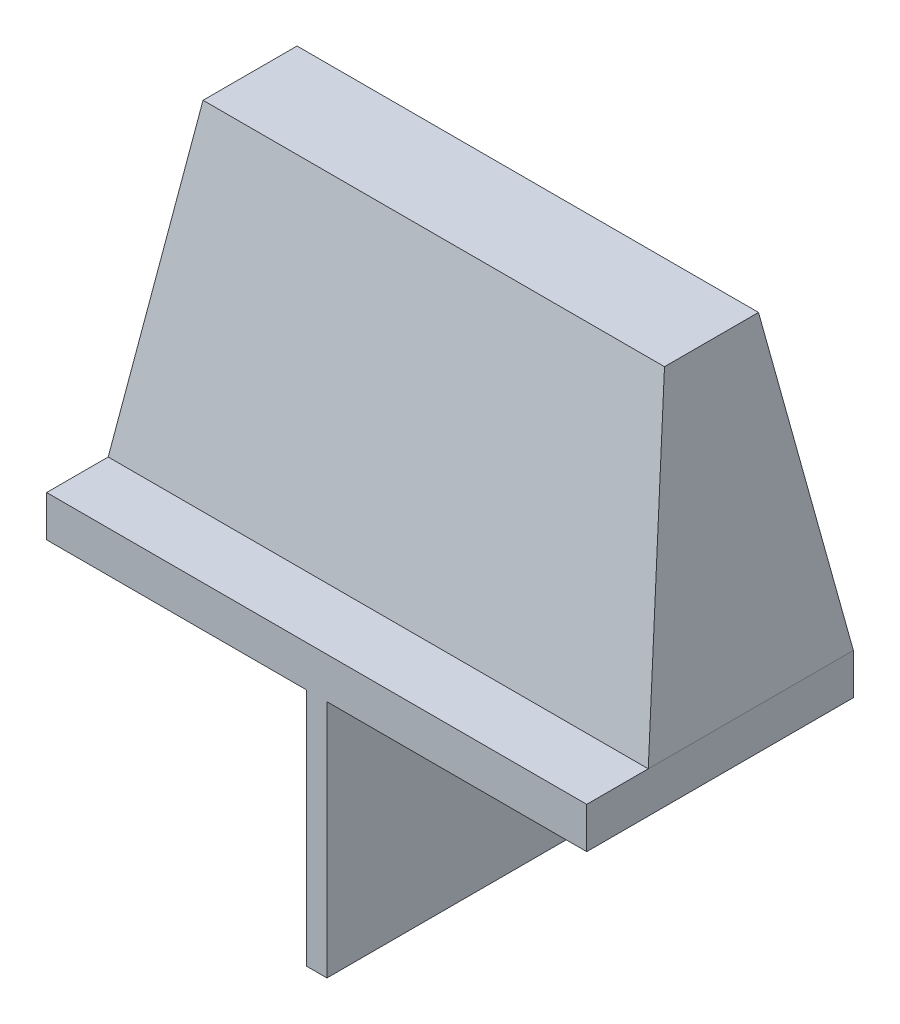
ISO-10303-21;
HEADER;
FILE_DESCRIPTION(('STEP AP214'),'2;1');
FILE_NAME('part.step','',(''),(''),'','','');
FILE_SCHEMA(('AUTOMOTIVE_DESIGN { 1 0 10303 214 1 1 1 1 }'));
ENDSEC;
DATA;
#1=APPLICATION_CONTEXT('core data for automotive mechanical design processes');
#2=APPLICATION_PROTOCOL_DEFINITION('international standard','automotive_design',2000,#1);
#3=PRODUCT_CONTEXT('',#1,'mechanical');
#4=PRODUCT('Part','Part','',(#3));
#5=PRODUCT_RELATED_PRODUCT_CATEGORY('part','',(#4));
#6=PRODUCT_DEFINITION_FORMATION('','',#4);
#7=PRODUCT_DEFINITION_CONTEXT('part definition',#1,'design');
#8=PRODUCT_DEFINITION('design','',#6,#7);
#9=PRODUCT_DEFINITION_SHAPE('','',#8);
#10=(LENGTH_UNIT() NAMED_UNIT(*) SI_UNIT(.MILLI.,.METRE.));
#11=(NAMED_UNIT(*) PLANE_ANGLE_UNIT() SI_UNIT($,.RADIAN.));
#12=(NAMED_UNIT(*) SI_UNIT($,.STERADIAN.) SOLID_ANGLE_UNIT());
#13=UNCERTAINTY_MEASURE_WITH_UNIT(LENGTH_MEASURE(1.E-05),#10,'distance_accuracy_value','');
#14=(GEOMETRIC_REPRESENTATION_CONTEXT(3) GLOBAL_UNCERTAINTY_ASSIGNED_CONTEXT((#13)) GLOBAL_UNIT_ASSIGNED_CONTEXT((#10,
#11,#12)) REPRESENTATION_CONTEXT('',''));
#15=CARTESIAN_POINT('',(0.,0.,0.));
#16=DIRECTION('',(0.,0.,1.));
#17=DIRECTION('',(1.,0.,0.));
#18=AXIS2_PLACEMENT_3D('',#15,#16,#17);
#19=CARTESIAN_POINT('',(0.,0.,0.));
#20=DIRECTION('',(0.,-1.,0.));
#21=DIRECTION('',(0.,0.,-1.));
#22=AXIS2_PLACEMENT_3D('',#19,#20,#21);
#23=PLANE('',#22);
#24=DIRECTION('',(-1.,0.,0.));
#25=VECTOR('',#24,1.);
#26=CARTESIAN_POINT('',(0.,0.,-19.812));
#27=LINE('',#26,#25);
#28=CARTESIAN_POINT('',(19.304,0.,-19.812));
#29=VERTEX_POINT('',#28);
#30=CARTESIAN_POINT('',(0.,0.,-19.812));
#31=VERTEX_POINT('',#30);
#32=EDGE_CURVE('E359',#29,#31,#27,.T.);
#33=ORIENTED_EDGE('',*,*,#32,.F.);
#34=DIRECTION('',(0.,0.,1.));
#35=VECTOR('',#34,1.);
#36=CARTESIAN_POINT('',(19.304,0.,-19.812));
#37=LINE('',#36,#35);
#38=CARTESIAN_POINT('',(19.304,0.,0.));
#39=VERTEX_POINT('',#38);
#40=EDGE_CURVE('E173',#29,#39,#37,.T.);
#41=ORIENTED_EDGE('',*,*,#40,.T.);
#42=DIRECTION('',(1.,0.,0.));
#43=VECTOR('',#42,1.);
#44=CARTESIAN_POINT('',(0.,0.,0.));
#45=LINE('',#44,#43);
#46=CARTESIAN_POINT('',(0.,0.,0.));
#47=VERTEX_POINT('',#46);
#48=EDGE_CURVE('E148',#47,#39,#45,.T.);
#49=ORIENTED_EDGE('',*,*,#48,.F.);
#50=DIRECTION('',(0.,0.,1.));
#51=VECTOR('',#50,1.);
#52=CARTESIAN_POINT('',(0.,0.,0.));
#53=LINE('',#52,#51);
#54=EDGE_CURVE('E310',#31,#47,#53,.T.);
#55=ORIENTED_EDGE('',*,*,#54,.F.);
#56=EDGE_LOOP('',(#33,#41,#49,#55));
#57=FACE_BOUND('',#56,.T.);
#58=ADVANCED_FACE('F53',(#57),#23,.T.);
#59=CARTESIAN_POINT('',(20.828,0.,0.));
#60=VERTEX_POINT('',#59);
#61=CARTESIAN_POINT('',(40.132,0.,0.));
#62=VERTEX_POINT('',#61);
#63=EDGE_CURVE('E368',#60,#62,#45,.T.);
#64=ORIENTED_EDGE('',*,*,#63,.F.);
#65=DIRECTION('',(0.,0.,-1.));
#66=VECTOR('',#65,1.);
#67=CARTESIAN_POINT('',(20.828,0.,-19.812));
#68=LINE('',#67,#66);
#69=CARTESIAN_POINT('',(20.828,0.,-19.812));
#70=VERTEX_POINT('',#69);
#71=EDGE_CURVE('E170',#60,#70,#68,.T.);
#72=ORIENTED_EDGE('',*,*,#71,.T.);
#73=CARTESIAN_POINT('',(40.132,0.,-19.812));
#74=VERTEX_POINT('',#73);
#75=EDGE_CURVE('E354',#74,#70,#27,.T.);
#76=ORIENTED_EDGE('',*,*,#75,.F.);
#77=DIRECTION('',(0.,0.,-1.));
#78=VECTOR('',#77,1.);
#79=CARTESIAN_POINT('',(40.132,0.,0.));
#80=LINE('',#79,#78);
#81=EDGE_CURVE('E298',#62,#74,#80,.T.);
#82=ORIENTED_EDGE('',*,*,#81,.F.);
#83=EDGE_LOOP('',(#64,#72,#76,#82));
#84=FACE_BOUND('',#83,.T.);
#85=ADVANCED_FACE('F455',(#84),#23,.T.);
#86=CARTESIAN_POINT('',(0.,0.,0.));
#87=DIRECTION('',(-1.,0.,0.));
#88=DIRECTION('',(0.,0.,1.));
#89=AXIS2_PLACEMENT_3D('',#86,#87,#88);
#90=PLANE('',#89);
#91=CARTESIAN_POINT('',(0.,3.048,-19.812));
#92=DIRECTION('',(0.,0.,1.));
#93=VECTOR('',#92,1.);
#94=LINE('',#91,#93);
#95=CARTESIAN_POINT('',(0.,3.048,-19.812));
#96=VERTEX_POINT('',#95);
#97=CARTESIAN_POINT('',(0.,3.048,-4.572));
#98=VERTEX_POINT('',#97);
#99=EDGE_CURVE('E395',#96,#98,#94,.T.);
#100=ORIENTED_EDGE('',*,*,#99,.F.);
#101=DIRECTION('',(0.,1.,0.));
#102=VECTOR('',#101,1.);
#103=CARTESIAN_POINT('',(0.,0.,-19.812));
#104=LINE('',#103,#102);
#105=EDGE_CURVE('E12',#31,#96,#104,.T.);
#106=ORIENTED_EDGE('',*,*,#105,.F.);
#107=ORIENTED_EDGE('',*,*,#54,.T.);
#108=DIRECTION('',(0.,1.,0.));
#109=VECTOR('',#108,1.);
#110=CARTESIAN_POINT('',(0.,0.,0.));
#111=LINE('',#110,#109);
#112=CARTESIAN_POINT('',(0.,3.048,0.));
#113=VERTEX_POINT('',#112);
#114=EDGE_CURVE('E351',#47,#113,#111,.T.);
#115=ORIENTED_EDGE('',*,*,#114,.T.);
#116=DIRECTION('',(0.,0.,1.));
#117=VECTOR('',#116,1.);
#118=CARTESIAN_POINT('',(0.,3.048,0.));
#119=LINE('',#118,#117);
#120=EDGE_CURVE('E344',#98,#113,#119,.T.);
#121=ORIENTED_EDGE('',*,*,#120,.F.);
#122=EDGE_LOOP('',(#100,#106,#107,#115,#121));
#123=FACE_BOUND('',#122,.T.);
#124=ADVANCED_FACE('F55',(#123),#90,.T.);
#125=CARTESIAN_POINT('',(0.,0.,-19.812));
#126=DIRECTION('',(0.,0.,-1.));
#127=DIRECTION('',(-1.,0.,0.));
#128=AXIS2_PLACEMENT_3D('',#125,#126,#127);
#129=PLANE('',#128);
#130=CARTESIAN_POINT('',(40.132,3.048,-19.812));
#131=DIRECTION('',(-1.,0.,0.));
#132=VECTOR('',#131,1.);
#133=LINE('',#130,#132);
#134=CARTESIAN_POINT('',(40.132,3.048,-19.812));
#135=VERTEX_POINT('',#134);
#136=EDGE_CURVE('E194',#135,#96,#133,.T.);
#137=ORIENTED_EDGE('',*,*,#136,.F.);
#138=DIRECTION('',(0.,1.,0.));
#139=VECTOR('',#138,1.);
#140=CARTESIAN_POINT('',(40.132,0.,-19.812));
#141=LINE('',#140,#139);
#142=EDGE_CURVE('E65',#74,#135,#141,.T.);
#143=ORIENTED_EDGE('',*,*,#142,.F.);
#144=ORIENTED_EDGE('',*,*,#75,.T.);
#145=DIRECTION('',(0.,1.,0.));
#146=VECTOR('',#145,1.);
#147=CARTESIAN_POINT('',(20.828,-17.78,-19.812));
#148=LINE('',#147,#146);
#149=CARTESIAN_POINT('',(20.828,-17.78,-19.812));
#150=VERTEX_POINT('',#149);
#151=EDGE_CURVE('E73',#150,#70,#148,.T.);
#152=ORIENTED_EDGE('',*,*,#151,.F.);
#153=DIRECTION('',(-1.,0.,0.));
#154=VECTOR('',#153,1.);
#155=CARTESIAN_POINT('',(19.304,-17.78,-19.812));
#156=LINE('',#155,#154);
#157=CARTESIAN_POINT('',(19.304,-17.78,-19.812));
#158=VERTEX_POINT('',#157);
#159=EDGE_CURVE('E155',#150,#158,#156,.T.);
#160=ORIENTED_EDGE('',*,*,#159,.T.);
#161=DIRECTION('',(0.,1.,0.));
#162=VECTOR('',#161,1.);
#163=CARTESIAN_POINT('',(19.304,-17.78,-19.812));
#164=LINE('',#163,#162);
#165=EDGE_CURVE('E168',#158,#29,#164,.T.);
#166=ORIENTED_EDGE('',*,*,#165,.T.);
#167=ORIENTED_EDGE('',*,*,#32,.T.);
#168=ORIENTED_EDGE('',*,*,#105,.T.);
#169=EDGE_LOOP('',(#137,#143,#144,#152,#160,#166,#167,#168));
#170=FACE_BOUND('',#169,.T.);
#171=ADVANCED_FACE('F306',(#170),#129,.T.);
#172=CARTESIAN_POINT('',(40.132,0.,0.));
#173=DIRECTION('',(1.,0.,0.));
#174=DIRECTION('',(0.,0.,-1.));
#175=AXIS2_PLACEMENT_3D('',#172,#173,#174);
#176=PLANE('',#175);
#177=DIRECTION('',(0.,0.,-1.));
#178=VECTOR('',#177,1.);
#179=CARTESIAN_POINT('',(40.132,3.048,0.));
#180=LINE('',#179,#178);
#181=CARTESIAN_POINT('',(40.132,3.048,0.));
#182=VERTEX_POINT('',#181);
#183=CARTESIAN_POINT('',(40.132,3.048,-4.572));
#184=VERTEX_POINT('',#183);
#185=EDGE_CURVE('E311',#182,#184,#180,.T.);
#186=ORIENTED_EDGE('',*,*,#185,.F.);
#187=DIRECTION('',(0.,1.,0.));
#188=VECTOR('',#187,1.);
#189=CARTESIAN_POINT('',(40.132,0.,0.));
#190=LINE('',#189,#188);
#191=EDGE_CURVE('E303',#62,#182,#190,.T.);
#192=ORIENTED_EDGE('',*,*,#191,.F.);
#193=ORIENTED_EDGE('',*,*,#81,.T.);
#194=ORIENTED_EDGE('',*,*,#142,.T.);
#195=DIRECTION('',(0.,0.,-1.));
#196=VECTOR('',#195,1.);
#197=CARTESIAN_POINT('',(40.132,3.048,-19.812));
#198=LINE('',#197,#196);
#199=EDGE_CURVE('E58',#184,#135,#198,.T.);
#200=ORIENTED_EDGE('',*,*,#199,.F.);
#201=EDGE_LOOP('',(#186,#192,#193,#194,#200));
#202=FACE_BOUND('',#201,.T.);
#203=ADVANCED_FACE('F295',(#202),#176,.T.);
#204=CARTESIAN_POINT('',(0.,0.,0.));
#205=DIRECTION('',(0.,0.,1.));
#206=DIRECTION('',(1.,0.,0.));
#207=AXIS2_PLACEMENT_3D('',#204,#205,#206);
#208=PLANE('',#207);
#209=DIRECTION('',(1.,0.,0.));
#210=VECTOR('',#209,1.);
#211=CARTESIAN_POINT('',(0.,3.048,0.));
#212=LINE('',#211,#210);
#213=EDGE_CURVE('E343',#113,#182,#212,.T.);
#214=ORIENTED_EDGE('',*,*,#213,.F.);
#215=ORIENTED_EDGE('',*,*,#114,.F.);
#216=ORIENTED_EDGE('',*,*,#48,.T.);
#217=DIRECTION('',(0.,1.,0.));
#218=VECTOR('',#217,1.);
#219=CARTESIAN_POINT('',(19.304,-17.78,0.));
#220=LINE('',#219,#218);
#221=CARTESIAN_POINT('',(19.304,-17.78,0.));
#222=VERTEX_POINT('',#221);
#223=EDGE_CURVE('E142',#222,#39,#220,.T.);
#224=ORIENTED_EDGE('',*,*,#223,.F.);
#225=DIRECTION('',(1.,0.,0.));
#226=VECTOR('',#225,1.);
#227=CARTESIAN_POINT('',(19.304,-17.78,0.));
#228=LINE('',#227,#226);
#229=CARTESIAN_POINT('',(20.828,-17.78,0.));
#230=VERTEX_POINT('',#229);
#231=EDGE_CURVE('E146',#222,#230,#228,.T.);
#232=ORIENTED_EDGE('',*,*,#231,.T.);
#233=DIRECTION('',(0.,1.,0.));
#234=VECTOR('',#233,1.);
#235=CARTESIAN_POINT('',(20.828,-17.78,0.));
#236=LINE('',#235,#234);
#237=EDGE_CURVE('E154',#230,#60,#236,.T.);
#238=ORIENTED_EDGE('',*,*,#237,.T.);
#239=ORIENTED_EDGE('',*,*,#63,.T.);
#240=ORIENTED_EDGE('',*,*,#191,.T.);
#241=EDGE_LOOP('',(#214,#215,#216,#224,#232,#238,#239,#240));
#242=FACE_BOUND('',#241,.T.);
#243=ADVANCED_FACE('F145',(#242),#208,.T.);
#244=CARTESIAN_POINT('',(0.,3.048,0.));
#245=DIRECTION('',(0.,-1.,0.));
#246=DIRECTION('',(0.,0.,-1.));
#247=AXIS2_PLACEMENT_3D('',#244,#245,#246);
#248=PLANE('',#247);
#249=ORIENTED_EDGE('',*,*,#185,.T.);
#250=DIRECTION('',(1.,0.,0.));
#251=VECTOR('',#250,1.);
#252=CARTESIAN_POINT('',(40.132,3.048,-4.572));
#253=LINE('',#252,#251);
#254=EDGE_CURVE('E271',#98,#184,#253,.T.);
#255=ORIENTED_EDGE('',*,*,#254,.F.);
#256=ORIENTED_EDGE('',*,*,#120,.T.);
#257=ORIENTED_EDGE('',*,*,#213,.T.);
#258=EDGE_LOOP('',(#249,#255,#256,#257));
#259=FACE_BOUND('',#258,.T.);
#260=ADVANCED_FACE('F328',(#259),#248,.F.);
#261=CARTESIAN_POINT('',(0.,25.4,0.));
#262=DIRECTION('',(0.,1.,0.));
#263=DIRECTION('',(0.,0.,1.));
#264=AXIS2_PLACEMENT_3D('',#261,#262,#263);
#265=PLANE('',#264);
#266=DIRECTION('',(0.,0.,1.));
#267=VECTOR('',#266,1.);
#268=CARTESIAN_POINT('',(2.921,25.4,-15.6845));
#269=LINE('',#268,#267);
#270=CARTESIAN_POINT('',(2.921,25.4,-15.6845));
#271=VERTEX_POINT('',#270);
#272=CARTESIAN_POINT('',(2.921,25.4,-8.6995));
#273=VERTEX_POINT('',#272);
#274=EDGE_CURVE('E234',#271,#273,#269,.T.);
#275=ORIENTED_EDGE('',*,*,#274,.T.);
#276=DIRECTION('',(1.,0.,0.));
#277=VECTOR('',#276,1.);
#278=CARTESIAN_POINT('',(2.921,25.4,-8.6995));
#279=LINE('',#278,#277);
#280=CARTESIAN_POINT('',(37.211,25.4,-8.6995));
#281=VERTEX_POINT('',#280);
#282=EDGE_CURVE('E382',#273,#281,#279,.T.);
#283=ORIENTED_EDGE('',*,*,#282,.T.);
#284=DIRECTION('',(0.,0.,-1.));
#285=VECTOR('',#284,1.);
#286=CARTESIAN_POINT('',(37.211,25.4,-15.6845));
#287=LINE('',#286,#285);
#288=CARTESIAN_POINT('',(37.211,25.4,-15.6845));
#289=VERTEX_POINT('',#288);
#290=EDGE_CURVE('E386',#281,#289,#287,.T.);
#291=ORIENTED_EDGE('',*,*,#290,.T.);
#292=DIRECTION('',(-1.,0.,0.));
#293=VECTOR('',#292,1.);
#294=CARTESIAN_POINT('',(2.921,25.4,-15.6845));
#295=LINE('',#294,#293);
#296=EDGE_CURVE('E290',#289,#271,#295,.T.);
#297=ORIENTED_EDGE('',*,*,#296,.T.);
#298=EDGE_LOOP('',(#275,#283,#291,#297));
#299=FACE_BOUND('',#298,.T.);
#300=ADVANCED_FACE('F214',(#299),#265,.T.);
#301=CARTESIAN_POINT('',(0.,-0.71591567873003,-3.87695875250724));
#302=DIRECTION('',(0.,-0.181589042361552,-0.983374506327175));
#303=DIRECTION('',(0.,0.983374506327175,-0.181589042361552));
#304=AXIS2_PLACEMENT_3D('',#301,#302,#303);
#305=PLANE('',#304);
#306=DIRECTION('',(-0.127460994192343,0.975353694689236,-0.180107926576137));
#307=VECTOR('',#306,1.);
#308=CARTESIAN_POINT('',(40.132,3.048,-4.572));
#309=LINE('',#308,#307);
#310=EDGE_CURVE('E265',#184,#281,#309,.T.);
#311=ORIENTED_EDGE('',*,*,#310,.T.);
#312=ORIENTED_EDGE('',*,*,#282,.F.);
#313=DIRECTION('',(0.127460994192343,0.975353694689236,-0.180107926576138));
#314=VECTOR('',#313,1.);
#315=CARTESIAN_POINT('',(0.,3.048,-4.572));
#316=LINE('',#315,#314);
#317=EDGE_CURVE('E81',#98,#273,#316,.T.);
#318=ORIENTED_EDGE('',*,*,#317,.F.);
#319=ORIENTED_EDGE('',*,*,#254,.T.);
#320=EDGE_LOOP('',(#311,#312,#318,#319));
#321=FACE_BOUND('',#320,.T.);
#322=ADVANCED_FACE('F248',(#321),#305,.F.);
#323=CARTESIAN_POINT('',(-0.391630026979844,0.0511789239803206,0.));
#324=DIRECTION('',(0.99156896605438,-0.129580035336652,0.));
#325=DIRECTION('',(0.129580035336652,0.99156896605438,0.));
#326=AXIS2_PLACEMENT_3D('',#323,#324,#325);
#327=PLANE('',#326);
#328=ORIENTED_EDGE('',*,*,#317,.T.);
#329=ORIENTED_EDGE('',*,*,#274,.F.);
#330=DIRECTION('',(0.127460994192343,0.975353694689236,0.180107926576137));
#331=VECTOR('',#330,1.);
#332=CARTESIAN_POINT('',(0.,3.048,-19.812));
#333=LINE('',#332,#331);
#334=EDGE_CURVE('E293',#96,#271,#333,.T.);
#335=ORIENTED_EDGE('',*,*,#334,.F.);
#336=ORIENTED_EDGE('',*,*,#99,.T.);
#337=EDGE_LOOP('',(#328,#329,#335,#336));
#338=FACE_BOUND('',#337,.T.);
#339=ADVANCED_FACE('F239',(#338),#327,.F.);
#340=CARTESIAN_POINT('',(39.8497741945723,5.2076409458816,0.));
#341=DIRECTION('',(-0.99156896605438,-0.129580035336652,0.));
#342=DIRECTION('',(0.129580035336652,-0.99156896605438,0.));
#343=AXIS2_PLACEMENT_3D('',#340,#341,#342);
#344=PLANE('',#343);
#345=DIRECTION('',(-0.127460994192343,0.975353694689236,0.180107926576137));
#346=VECTOR('',#345,1.);
#347=CARTESIAN_POINT('',(40.132,3.048,-19.812));
#348=LINE('',#347,#346);
#349=EDGE_CURVE('E199',#135,#289,#348,.T.);
#350=ORIENTED_EDGE('',*,*,#349,.T.);
#351=ORIENTED_EDGE('',*,*,#290,.F.);
#352=ORIENTED_EDGE('',*,*,#310,.F.);
#353=ORIENTED_EDGE('',*,*,#199,.T.);
#354=EDGE_LOOP('',(#350,#351,#352,#353));
#355=FACE_BOUND('',#354,.T.);
#356=ADVANCED_FACE('F211',(#355),#344,.F.);
#357=CARTESIAN_POINT('',(0.,3.63833605194765,-19.7029890813165));
#358=DIRECTION('',(0.,-0.181589042361552,0.983374506327175));
#359=DIRECTION('',(0.,-0.983374506327175,-0.181589042361552));
#360=AXIS2_PLACEMENT_3D('',#357,#358,#359);
#361=PLANE('',#360);
#362=ORIENTED_EDGE('',*,*,#334,.T.);
#363=ORIENTED_EDGE('',*,*,#296,.F.);
#364=ORIENTED_EDGE('',*,*,#349,.F.);
#365=ORIENTED_EDGE('',*,*,#136,.T.);
#366=EDGE_LOOP('',(#362,#363,#364,#365));
#367=FACE_BOUND('',#366,.T.);
#368=ADVANCED_FACE('F201',(#367),#361,.F.);
#369=CARTESIAN_POINT('',(19.304,-17.78,-19.812));
#370=DIRECTION('',(-1.,0.,0.));
#371=DIRECTION('',(0.,0.,1.));
#372=AXIS2_PLACEMENT_3D('',#369,#370,#371);
#373=PLANE('',#372);
#374=ORIENTED_EDGE('',*,*,#40,.F.);
#375=ORIENTED_EDGE('',*,*,#165,.F.);
#376=DIRECTION('',(0.,0.,1.));
#377=VECTOR('',#376,1.);
#378=CARTESIAN_POINT('',(19.304,-17.78,-19.812));
#379=LINE('',#378,#377);
#380=EDGE_CURVE('E162',#158,#222,#379,.T.);
#381=ORIENTED_EDGE('',*,*,#380,.T.);
#382=ORIENTED_EDGE('',*,*,#223,.T.);
#383=EDGE_LOOP('',(#374,#375,#381,#382));
#384=FACE_BOUND('',#383,.T.);
#385=ADVANCED_FACE('F167',(#384),#373,.T.);
#386=CARTESIAN_POINT('',(20.828,-17.78,-19.812));
#387=DIRECTION('',(1.,0.,0.));
#388=DIRECTION('',(0.,0.,-1.));
#389=AXIS2_PLACEMENT_3D('',#386,#387,#388);
#390=PLANE('',#389);
#391=ORIENTED_EDGE('',*,*,#71,.F.);
#392=ORIENTED_EDGE('',*,*,#237,.F.);
#393=DIRECTION('',(0.,0.,-1.));
#394=VECTOR('',#393,1.);
#395=CARTESIAN_POINT('',(20.828,-17.78,-19.812));
#396=LINE('',#395,#394);
#397=EDGE_CURVE('E164',#230,#150,#396,.T.);
#398=ORIENTED_EDGE('',*,*,#397,.T.);
#399=ORIENTED_EDGE('',*,*,#151,.T.);
#400=EDGE_LOOP('',(#391,#392,#398,#399));
#401=FACE_BOUND('',#400,.T.);
#402=ADVANCED_FACE('F456',(#401),#390,.T.);
#403=CARTESIAN_POINT('',(0.,-17.78,0.));
#404=DIRECTION('',(0.,1.,0.));
#405=DIRECTION('',(0.,0.,1.));
#406=AXIS2_PLACEMENT_3D('',#403,#404,#405);
#407=PLANE('',#406);
#408=ORIENTED_EDGE('',*,*,#380,.F.);
#409=ORIENTED_EDGE('',*,*,#159,.F.);
#410=ORIENTED_EDGE('',*,*,#397,.F.);
#411=ORIENTED_EDGE('',*,*,#231,.F.);
#412=EDGE_LOOP('',(#408,#409,#410,#411));
#413=FACE_BOUND('',#412,.T.);
#414=ADVANCED_FACE('F160',(#413),#407,.F.);
#415=CLOSED_SHELL('',(#58,#85,#124,#171,#203,#243,#260,#300,#322,#339,#356,#368,#385,#402,#414));
#416=MANIFOLD_SOLID_BREP('B2',#415);
#417=ADVANCED_BREP_SHAPE_REPRESENTATION('',(#18,#416),#14);
#418=SHAPE_DEFINITION_REPRESENTATION(#9,#417);
ENDSEC;
END-ISO-10303-21;
